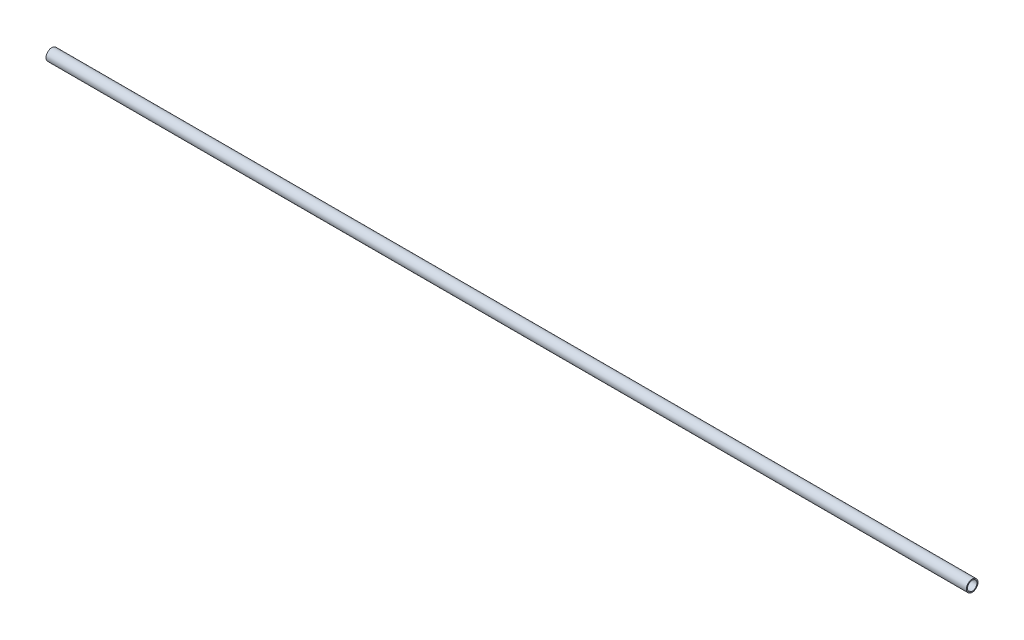
ISO-10303-21;
HEADER;
FILE_DESCRIPTION(('STEP AP214'),'2;1');
FILE_NAME('part.step','',(''),(''),'','','');
FILE_SCHEMA(('AUTOMOTIVE_DESIGN { 1 0 10303 214 1 1 1 1 }'));
ENDSEC;
DATA;
#1=APPLICATION_CONTEXT('core data for automotive mechanical design processes');
#2=APPLICATION_PROTOCOL_DEFINITION('international standard','automotive_design',2000,#1);
#3=PRODUCT_CONTEXT('',#1,'mechanical');
#4=PRODUCT('Part','Part','',(#3));
#5=PRODUCT_RELATED_PRODUCT_CATEGORY('part','',(#4));
#6=PRODUCT_DEFINITION_FORMATION('','',#4);
#7=PRODUCT_DEFINITION_CONTEXT('part definition',#1,'design');
#8=PRODUCT_DEFINITION('design','',#6,#7);
#9=PRODUCT_DEFINITION_SHAPE('','',#8);
#10=(LENGTH_UNIT() NAMED_UNIT(*) SI_UNIT(.MILLI.,.METRE.));
#11=(NAMED_UNIT(*) PLANE_ANGLE_UNIT() SI_UNIT($,.RADIAN.));
#12=(NAMED_UNIT(*) SI_UNIT($,.STERADIAN.) SOLID_ANGLE_UNIT());
#13=UNCERTAINTY_MEASURE_WITH_UNIT(LENGTH_MEASURE(1.E-05),#10,'distance_accuracy_value','');
#14=(GEOMETRIC_REPRESENTATION_CONTEXT(3) GLOBAL_UNCERTAINTY_ASSIGNED_CONTEXT((#13)) GLOBAL_UNIT_ASSIGNED_CONTEXT((#10,
#11,#12)) REPRESENTATION_CONTEXT('',''));
#15=CARTESIAN_POINT('',(0.,0.,0.));
#16=DIRECTION('',(0.,0.,1.));
#17=DIRECTION('',(1.,0.,0.));
#18=AXIS2_PLACEMENT_3D('',#15,#16,#17);
#19=CARTESIAN_POINT('',(0.,0.,0.));
#20=DIRECTION('',(1.,0.,0.));
#21=DIRECTION('',(0.,0.,-1.));
#22=AXIS2_PLACEMENT_3D('',#19,#20,#21);
#23=CYLINDRICAL_SURFACE('',#22,25.7);
#24=CARTESIAN_POINT('',(0.,0.,0.));
#25=DIRECTION('',(1.,0.,0.));
#26=DIRECTION('',(0.,0.,-1.));
#27=AXIS2_PLACEMENT_3D('',#24,#25,#26);
#28=CIRCLE('',#27,25.7);
#29=CARTESIAN_POINT('',(0.,0.,-25.7));
#30=VERTEX_POINT('',#29);
#31=EDGE_CURVE('E16',#30,#30,#28,.T.);
#32=ORIENTED_EDGE('',*,*,#31,.F.);
#33=EDGE_LOOP('',(#32));
#34=FACE_BOUND('',#33,.T.);
#35=CARTESIAN_POINT('',(5000.,0.,0.));
#36=DIRECTION('',(1.,0.,0.));
#37=DIRECTION('',(0.,0.,-1.));
#38=AXIS2_PLACEMENT_3D('',#35,#36,#37);
#39=CIRCLE('',#38,25.7);
#40=CARTESIAN_POINT('',(5000.,0.,-25.7));
#41=VERTEX_POINT('',#40);
#42=EDGE_CURVE('E25',#41,#41,#39,.F.);
#43=ORIENTED_EDGE('',*,*,#42,.F.);
#44=EDGE_LOOP('',(#43));
#45=FACE_BOUND('',#44,.T.);
#46=ADVANCED_FACE('F13',(#34,#45),#23,.F.);
#47=CARTESIAN_POINT('',(0.,-31.8780010542674,-31.5));
#48=DIRECTION('',(-1.,0.,0.));
#49=DIRECTION('',(0.,0.,1.));
#50=AXIS2_PLACEMENT_3D('',#47,#48,#49);
#51=PLANE('',#50);
#52=ORIENTED_EDGE('',*,*,#31,.T.);
#53=EDGE_LOOP('',(#52));
#54=FACE_BOUND('',#53,.T.);
#55=CARTESIAN_POINT('',(0.,0.,0.));
#56=DIRECTION('',(1.,0.,0.));
#57=DIRECTION('',(0.,0.,-1.));
#58=AXIS2_PLACEMENT_3D('',#55,#56,#57);
#59=CIRCLE('',#58,31.5);
#60=CARTESIAN_POINT('',(0.,0.,-31.5));
#61=VERTEX_POINT('',#60);
#62=EDGE_CURVE('E20',#61,#61,#59,.T.);
#63=ORIENTED_EDGE('',*,*,#62,.F.);
#64=EDGE_LOOP('',(#63));
#65=FACE_BOUND('',#64,.T.);
#66=ADVANCED_FACE('F33',(#54,#65),#51,.T.);
#67=CARTESIAN_POINT('',(5000.,-31.8780010542674,31.5));
#68=DIRECTION('',(1.,0.,0.));
#69=DIRECTION('',(0.,0.,-1.));
#70=AXIS2_PLACEMENT_3D('',#67,#68,#69);
#71=PLANE('',#70);
#72=ORIENTED_EDGE('',*,*,#42,.T.);
#73=EDGE_LOOP('',(#72));
#74=FACE_BOUND('',#73,.T.);
#75=CARTESIAN_POINT('',(5000.,0.,0.));
#76=DIRECTION('',(1.,0.,0.));
#77=DIRECTION('',(0.,0.,-1.));
#78=AXIS2_PLACEMENT_3D('',#75,#76,#77);
#79=CIRCLE('',#78,31.5);
#80=CARTESIAN_POINT('',(5000.,0.,-31.5));
#81=VERTEX_POINT('',#80);
#82=EDGE_CURVE('E8',#81,#81,#79,.F.);
#83=ORIENTED_EDGE('',*,*,#82,.F.);
#84=EDGE_LOOP('',(#83));
#85=FACE_BOUND('',#84,.T.);
#86=ADVANCED_FACE('F42',(#74,#85),#71,.T.);
#87=CARTESIAN_POINT('',(5000.,0.,0.));
#88=DIRECTION('',(1.,0.,0.));
#89=DIRECTION('',(0.,0.,-1.));
#90=AXIS2_PLACEMENT_3D('',#87,#88,#89);
#91=CYLINDRICAL_SURFACE('',#90,31.5);
#92=ORIENTED_EDGE('',*,*,#62,.T.);
#93=EDGE_LOOP('',(#92));
#94=FACE_BOUND('',#93,.T.);
#95=ORIENTED_EDGE('',*,*,#82,.T.);
#96=EDGE_LOOP('',(#95));
#97=FACE_BOUND('',#96,.T.);
#98=ADVANCED_FACE('F43',(#94,#97),#91,.T.);
#99=CLOSED_SHELL('',(#46,#66,#86,#98));
#100=MANIFOLD_SOLID_BREP('B1',#99);
#101=ADVANCED_BREP_SHAPE_REPRESENTATION('',(#18,#100),#14);
#102=SHAPE_DEFINITION_REPRESENTATION(#9,#101);
ENDSEC;
END-ISO-10303-21;
